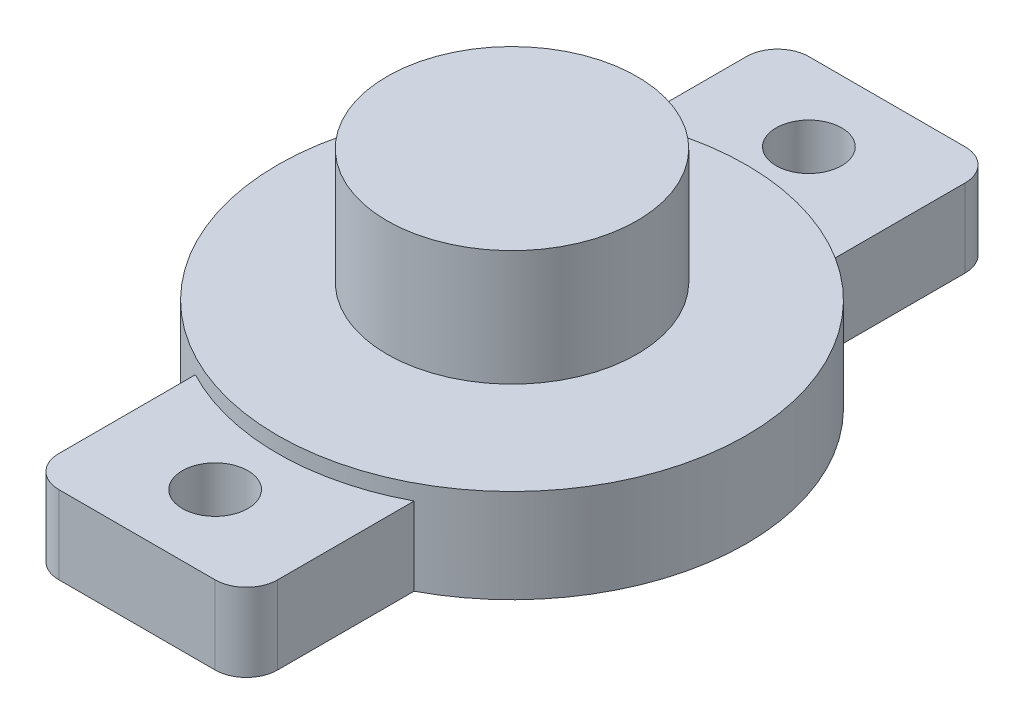
ISO-10303-21;
HEADER;
FILE_DESCRIPTION(('STEP AP214'),'2;1');
FILE_NAME('part.step','',(''),(''),'','','');
FILE_SCHEMA(('AUTOMOTIVE_DESIGN { 1 0 10303 214 1 1 1 1 }'));
ENDSEC;
DATA;
#1=APPLICATION_CONTEXT('core data for automotive mechanical design processes');
#2=APPLICATION_PROTOCOL_DEFINITION('international standard','automotive_design',2000,#1);
#3=PRODUCT_CONTEXT('',#1,'mechanical');
#4=PRODUCT('Part','Part','',(#3));
#5=PRODUCT_RELATED_PRODUCT_CATEGORY('part','',(#4));
#6=PRODUCT_DEFINITION_FORMATION('','',#4);
#7=PRODUCT_DEFINITION_CONTEXT('part definition',#1,'design');
#8=PRODUCT_DEFINITION('design','',#6,#7);
#9=PRODUCT_DEFINITION_SHAPE('','',#8);
#10=(LENGTH_UNIT() NAMED_UNIT(*) SI_UNIT(.MILLI.,.METRE.));
#11=(NAMED_UNIT(*) PLANE_ANGLE_UNIT() SI_UNIT($,.RADIAN.));
#12=(NAMED_UNIT(*) SI_UNIT($,.STERADIAN.) SOLID_ANGLE_UNIT());
#13=UNCERTAINTY_MEASURE_WITH_UNIT(LENGTH_MEASURE(1.E-05),#10,'distance_accuracy_value','');
#14=(GEOMETRIC_REPRESENTATION_CONTEXT(3) GLOBAL_UNCERTAINTY_ASSIGNED_CONTEXT((#13)) GLOBAL_UNIT_ASSIGNED_CONTEXT((#10,
#11,#12)) REPRESENTATION_CONTEXT('',''));
#15=CARTESIAN_POINT('',(0.,0.,0.));
#16=DIRECTION('',(0.,0.,1.));
#17=DIRECTION('',(1.,0.,0.));
#18=AXIS2_PLACEMENT_3D('',#15,#16,#17);
#19=CARTESIAN_POINT('',(0.,3.,0.));
#20=DIRECTION('',(0.,1.,0.));
#21=DIRECTION('',(0.,0.,1.));
#22=AXIS2_PLACEMENT_3D('',#19,#20,#21);
#23=PLANE('',#22);
#24=CARTESIAN_POINT('',(0.,3.,0.));
#25=DIRECTION('',(0.,1.,0.));
#26=DIRECTION('',(0.,0.,1.));
#27=AXIS2_PLACEMENT_3D('',#24,#25,#26);
#28=CIRCLE('',#27,7.5);
#29=CARTESIAN_POINT('',(0.,3.,7.5));
#30=VERTEX_POINT('',#29);
#31=EDGE_CURVE('E148',#30,#30,#28,.T.);
#32=ORIENTED_EDGE('',*,*,#31,.T.);
#33=EDGE_LOOP('',(#32));
#34=FACE_BOUND('',#33,.T.);
#35=CARTESIAN_POINT('',(0.,3.,0.));
#36=DIRECTION('',(0.,1.,0.));
#37=DIRECTION('',(0.,0.,1.));
#38=AXIS2_PLACEMENT_3D('',#35,#36,#37);
#39=CIRCLE('',#38,1.56120543949607);
#40=CARTESIAN_POINT('',(0.,3.,1.56120543949607));
#41=VERTEX_POINT('',#40);
#42=EDGE_CURVE('E441',#41,#41,#39,.T.);
#43=ORIENTED_EDGE('',*,*,#42,.F.);
#44=EDGE_LOOP('',(#43));
#45=FACE_BOUND('',#44,.T.);
#46=ADVANCED_FACE('F34',(#34,#45),#23,.T.);
#47=CARTESIAN_POINT('',(3.5,2.5,12.));
#48=DIRECTION('',(-1.,0.,0.));
#49=DIRECTION('',(0.,0.,1.));
#50=AXIS2_PLACEMENT_3D('',#47,#48,#49);
#51=PLANE('',#50);
#52=DIRECTION('',(0.,-1.,0.));
#53=VECTOR('',#52,1.);
#54=CARTESIAN_POINT('',(3.5,3.,-6.6332495807108));
#55=LINE('',#54,#53);
#56=CARTESIAN_POINT('',(3.5,0.,-6.6332495807108));
#57=VERTEX_POINT('',#56);
#58=CARTESIAN_POINT('',(3.5,2.5,-6.6332495807108));
#59=VERTEX_POINT('',#58);
#60=EDGE_CURVE('E143',#57,#59,#55,.F.);
#61=ORIENTED_EDGE('',*,*,#60,.F.);
#62=DIRECTION('',(0.,0.,-1.));
#63=VECTOR('',#62,1.);
#64=CARTESIAN_POINT('',(3.5,0.,12.));
#65=LINE('',#64,#63);
#66=CARTESIAN_POINT('',(3.5,0.,-11.));
#67=VERTEX_POINT('',#66);
#68=EDGE_CURVE('E161',#57,#67,#65,.T.);
#69=ORIENTED_EDGE('',*,*,#68,.T.);
#70=DIRECTION('',(0.,-1.,0.));
#71=VECTOR('',#70,1.);
#72=CARTESIAN_POINT('',(3.5,2.5,-11.));
#73=LINE('',#72,#71);
#74=CARTESIAN_POINT('',(3.5,2.5,-11.));
#75=VERTEX_POINT('',#74);
#76=EDGE_CURVE('E197',#67,#75,#73,.F.);
#77=ORIENTED_EDGE('',*,*,#76,.T.);
#78=DIRECTION('',(0.,0.,-1.));
#79=VECTOR('',#78,1.);
#80=CARTESIAN_POINT('',(3.5,2.5,12.));
#81=LINE('',#80,#79);
#82=EDGE_CURVE('E165',#59,#75,#81,.T.);
#83=ORIENTED_EDGE('',*,*,#82,.F.);
#84=EDGE_LOOP('',(#61,#69,#77,#83));
#85=FACE_BOUND('',#84,.T.);
#86=ADVANCED_FACE('F257',(#85),#51,.F.);
#87=DIRECTION('',(0.,-1.,0.));
#88=VECTOR('',#87,1.);
#89=CARTESIAN_POINT('',(3.5,3.,6.6332495807108));
#90=LINE('',#89,#88);
#91=CARTESIAN_POINT('',(3.5,2.5,6.6332495807108));
#92=VERTEX_POINT('',#91);
#93=CARTESIAN_POINT('',(3.5,0.,6.6332495807108));
#94=VERTEX_POINT('',#93);
#95=EDGE_CURVE('E156',#92,#94,#90,.T.);
#96=ORIENTED_EDGE('',*,*,#95,.F.);
#97=CARTESIAN_POINT('',(3.5,2.5,11.));
#98=VERTEX_POINT('',#97);
#99=EDGE_CURVE('E162',#98,#92,#81,.T.);
#100=ORIENTED_EDGE('',*,*,#99,.F.);
#101=DIRECTION('',(0.,-1.,0.));
#102=VECTOR('',#101,1.);
#103=CARTESIAN_POINT('',(3.5,2.5,11.));
#104=LINE('',#103,#102);
#105=CARTESIAN_POINT('',(3.5,0.,11.));
#106=VERTEX_POINT('',#105);
#107=EDGE_CURVE('E194',#98,#106,#104,.T.);
#108=ORIENTED_EDGE('',*,*,#107,.T.);
#109=EDGE_CURVE('E170',#106,#94,#65,.T.);
#110=ORIENTED_EDGE('',*,*,#109,.T.);
#111=EDGE_LOOP('',(#96,#100,#108,#110));
#112=FACE_BOUND('',#111,.T.);
#113=ADVANCED_FACE('F263',(#112),#51,.F.);
#114=CARTESIAN_POINT('',(-3.5,2.5,12.));
#115=DIRECTION('',(1.,0.,0.));
#116=DIRECTION('',(0.,0.,-1.));
#117=AXIS2_PLACEMENT_3D('',#114,#115,#116);
#118=PLANE('',#117);
#119=DIRECTION('',(0.,-1.,0.));
#120=VECTOR('',#119,1.);
#121=CARTESIAN_POINT('',(-3.5,3.,6.6332495807108));
#122=LINE('',#121,#120);
#123=CARTESIAN_POINT('',(-3.5,0.,6.6332495807108));
#124=VERTEX_POINT('',#123);
#125=CARTESIAN_POINT('',(-3.5,2.5,6.6332495807108));
#126=VERTEX_POINT('',#125);
#127=EDGE_CURVE('E153',#124,#126,#122,.F.);
#128=ORIENTED_EDGE('',*,*,#127,.F.);
#129=DIRECTION('',(0.,0.,1.));
#130=VECTOR('',#129,1.);
#131=CARTESIAN_POINT('',(-3.5,0.,12.));
#132=LINE('',#131,#130);
#133=CARTESIAN_POINT('',(-3.5,0.,11.));
#134=VERTEX_POINT('',#133);
#135=EDGE_CURVE('E175',#124,#134,#132,.T.);
#136=ORIENTED_EDGE('',*,*,#135,.T.);
#137=DIRECTION('',(0.,-1.,0.));
#138=VECTOR('',#137,1.);
#139=CARTESIAN_POINT('',(-3.5,2.5,11.));
#140=LINE('',#139,#138);
#141=CARTESIAN_POINT('',(-3.5,2.5,11.));
#142=VERTEX_POINT('',#141);
#143=EDGE_CURVE('E207',#134,#142,#140,.F.);
#144=ORIENTED_EDGE('',*,*,#143,.T.);
#145=DIRECTION('',(0.,0.,1.));
#146=VECTOR('',#145,1.);
#147=CARTESIAN_POINT('',(-3.5,2.5,12.));
#148=LINE('',#147,#146);
#149=EDGE_CURVE('E133',#126,#142,#148,.T.);
#150=ORIENTED_EDGE('',*,*,#149,.F.);
#151=EDGE_LOOP('',(#128,#136,#144,#150));
#152=FACE_BOUND('',#151,.T.);
#153=ADVANCED_FACE('F235',(#152),#118,.F.);
#154=DIRECTION('',(0.,-1.,0.));
#155=VECTOR('',#154,1.);
#156=CARTESIAN_POINT('',(-3.5,3.,-6.6332495807108));
#157=LINE('',#156,#155);
#158=CARTESIAN_POINT('',(-3.5,2.5,-6.6332495807108));
#159=VERTEX_POINT('',#158);
#160=CARTESIAN_POINT('',(-3.5,0.,-6.6332495807108));
#161=VERTEX_POINT('',#160);
#162=EDGE_CURVE('E136',#159,#161,#157,.T.);
#163=ORIENTED_EDGE('',*,*,#162,.F.);
#164=CARTESIAN_POINT('',(-3.5,2.5,-11.));
#165=VERTEX_POINT('',#164);
#166=EDGE_CURVE('E123',#165,#159,#148,.T.);
#167=ORIENTED_EDGE('',*,*,#166,.F.);
#168=DIRECTION('',(0.,-1.,0.));
#169=VECTOR('',#168,1.);
#170=CARTESIAN_POINT('',(-3.5,2.5,-11.));
#171=LINE('',#170,#169);
#172=CARTESIAN_POINT('',(-3.5,0.,-11.));
#173=VERTEX_POINT('',#172);
#174=EDGE_CURVE('E210',#165,#173,#171,.T.);
#175=ORIENTED_EDGE('',*,*,#174,.T.);
#176=EDGE_CURVE('E139',#173,#161,#132,.T.);
#177=ORIENTED_EDGE('',*,*,#176,.T.);
#178=EDGE_LOOP('',(#163,#167,#175,#177));
#179=FACE_BOUND('',#178,.T.);
#180=ADVANCED_FACE('F137',(#179),#118,.F.);
#181=CARTESIAN_POINT('',(0.,2.5,0.));
#182=DIRECTION('',(0.,-1.,0.));
#183=DIRECTION('',(0.,0.,-1.));
#184=AXIS2_PLACEMENT_3D('',#181,#182,#183);
#185=PLANE('',#184);
#186=CARTESIAN_POINT('',(0.,2.5,9.5));
#187=DIRECTION('',(0.,1.,0.));
#188=DIRECTION('',(0.,0.,1.));
#189=AXIS2_PLACEMENT_3D('',#186,#187,#188);
#190=CIRCLE('',#189,1.05);
#191=CARTESIAN_POINT('',(0.,2.5,10.55));
#192=VERTEX_POINT('',#191);
#193=EDGE_CURVE('E225',#192,#192,#190,.T.);
#194=ORIENTED_EDGE('',*,*,#193,.F.);
#195=EDGE_LOOP('',(#194));
#196=FACE_BOUND('',#195,.T.);
#197=CARTESIAN_POINT('',(0.,2.5,0.));
#198=DIRECTION('',(0.,-1.,0.));
#199=DIRECTION('',(0.,0.,-1.));
#200=AXIS2_PLACEMENT_3D('',#197,#198,#199);
#201=CIRCLE('',#200,7.5);
#202=EDGE_CURVE('E51',#126,#92,#201,.F.);
#203=ORIENTED_EDGE('',*,*,#202,.F.);
#204=ORIENTED_EDGE('',*,*,#149,.T.);
#205=CARTESIAN_POINT('',(-2.5,2.5,11.));
#206=DIRECTION('',(0.,-1.,0.));
#207=DIRECTION('',(0.,0.,-1.));
#208=AXIS2_PLACEMENT_3D('',#205,#206,#207);
#209=CIRCLE('',#208,1.);
#210=CARTESIAN_POINT('',(-2.5,2.5,12.));
#211=VERTEX_POINT('',#210);
#212=EDGE_CURVE('E200',#142,#211,#209,.F.);
#213=ORIENTED_EDGE('',*,*,#212,.T.);
#214=DIRECTION('',(1.,0.,0.));
#215=VECTOR('',#214,1.);
#216=CARTESIAN_POINT('',(-3.5,2.5,12.));
#217=LINE('',#216,#215);
#218=CARTESIAN_POINT('',(2.5,2.5,12.));
#219=VERTEX_POINT('',#218);
#220=EDGE_CURVE('E132',#211,#219,#217,.T.);
#221=ORIENTED_EDGE('',*,*,#220,.T.);
#222=CARTESIAN_POINT('',(2.5,2.5,11.));
#223=DIRECTION('',(0.,-1.,0.));
#224=DIRECTION('',(0.,0.,-1.));
#225=AXIS2_PLACEMENT_3D('',#222,#223,#224);
#226=CIRCLE('',#225,1.);
#227=EDGE_CURVE('E202',#219,#98,#226,.F.);
#228=ORIENTED_EDGE('',*,*,#227,.T.);
#229=ORIENTED_EDGE('',*,*,#99,.T.);
#230=EDGE_LOOP('',(#203,#204,#213,#221,#228,#229));
#231=FACE_BOUND('',#230,.T.);
#232=ADVANCED_FACE('F237',(#196,#231),#185,.F.);
#233=CARTESIAN_POINT('',(0.,2.5,-9.5));
#234=DIRECTION('',(0.,1.,0.));
#235=DIRECTION('',(0.,0.,1.));
#236=AXIS2_PLACEMENT_3D('',#233,#234,#235);
#237=CIRCLE('',#236,1.05);
#238=CARTESIAN_POINT('',(0.,2.5,-8.45));
#239=VERTEX_POINT('',#238);
#240=EDGE_CURVE('E216',#239,#239,#237,.T.);
#241=ORIENTED_EDGE('',*,*,#240,.F.);
#242=EDGE_LOOP('',(#241));
#243=FACE_BOUND('',#242,.T.);
#244=EDGE_CURVE('E59',#59,#159,#201,.F.);
#245=ORIENTED_EDGE('',*,*,#244,.F.);
#246=ORIENTED_EDGE('',*,*,#82,.T.);
#247=CARTESIAN_POINT('',(2.5,2.5,-11.));
#248=DIRECTION('',(0.,-1.,0.));
#249=DIRECTION('',(0.,0.,-1.));
#250=AXIS2_PLACEMENT_3D('',#247,#248,#249);
#251=CIRCLE('',#250,1.);
#252=CARTESIAN_POINT('',(2.5,2.5,-12.));
#253=VERTEX_POINT('',#252);
#254=EDGE_CURVE('E205',#75,#253,#251,.F.);
#255=ORIENTED_EDGE('',*,*,#254,.T.);
#256=DIRECTION('',(-1.,0.,0.));
#257=VECTOR('',#256,1.);
#258=CARTESIAN_POINT('',(-3.5,2.5,-12.));
#259=LINE('',#258,#257);
#260=CARTESIAN_POINT('',(-2.5,2.5,-12.));
#261=VERTEX_POINT('',#260);
#262=EDGE_CURVE('E164',#253,#261,#259,.T.);
#263=ORIENTED_EDGE('',*,*,#262,.T.);
#264=CARTESIAN_POINT('',(-2.5,2.5,-11.));
#265=DIRECTION('',(0.,-1.,0.));
#266=DIRECTION('',(0.,0.,-1.));
#267=AXIS2_PLACEMENT_3D('',#264,#265,#266);
#268=CIRCLE('',#267,1.);
#269=EDGE_CURVE('E128',#261,#165,#268,.F.);
#270=ORIENTED_EDGE('',*,*,#269,.T.);
#271=ORIENTED_EDGE('',*,*,#166,.T.);
#272=EDGE_LOOP('',(#245,#246,#255,#263,#270,#271));
#273=FACE_BOUND('',#272,.T.);
#274=ADVANCED_FACE('F125',(#243,#273),#185,.F.);
#275=CARTESIAN_POINT('',(-3.5,2.5,-12.));
#276=DIRECTION('',(0.,0.,1.));
#277=DIRECTION('',(1.,0.,0.));
#278=AXIS2_PLACEMENT_3D('',#275,#276,#277);
#279=PLANE('',#278);
#280=ORIENTED_EDGE('',*,*,#262,.F.);
#281=DIRECTION('',(0.,-1.,0.));
#282=VECTOR('',#281,1.);
#283=CARTESIAN_POINT('',(2.5,2.5,-12.));
#284=LINE('',#283,#282);
#285=CARTESIAN_POINT('',(2.5,0.,-12.));
#286=VERTEX_POINT('',#285);
#287=EDGE_CURVE('E181',#253,#286,#284,.T.);
#288=ORIENTED_EDGE('',*,*,#287,.T.);
#289=DIRECTION('',(-1.,0.,0.));
#290=VECTOR('',#289,1.);
#291=CARTESIAN_POINT('',(-3.5,0.,-12.));
#292=LINE('',#291,#290);
#293=CARTESIAN_POINT('',(-2.5,0.,-12.));
#294=VERTEX_POINT('',#293);
#295=EDGE_CURVE('E172',#286,#294,#292,.T.);
#296=ORIENTED_EDGE('',*,*,#295,.T.);
#297=DIRECTION('',(0.,-1.,0.));
#298=VECTOR('',#297,1.);
#299=CARTESIAN_POINT('',(-2.5,2.5,-12.));
#300=LINE('',#299,#298);
#301=EDGE_CURVE('E169',#294,#261,#300,.F.);
#302=ORIENTED_EDGE('',*,*,#301,.T.);
#303=EDGE_LOOP('',(#280,#288,#296,#302));
#304=FACE_BOUND('',#303,.T.);
#305=ADVANCED_FACE('F279',(#304),#279,.F.);
#306=CARTESIAN_POINT('',(-3.5,2.5,12.));
#307=DIRECTION('',(0.,0.,-1.));
#308=DIRECTION('',(-1.,0.,0.));
#309=AXIS2_PLACEMENT_3D('',#306,#307,#308);
#310=PLANE('',#309);
#311=DIRECTION('',(1.,0.,0.));
#312=VECTOR('',#311,1.);
#313=CARTESIAN_POINT('',(-3.5,0.,12.));
#314=LINE('',#313,#312);
#315=CARTESIAN_POINT('',(-2.5,0.,12.));
#316=VERTEX_POINT('',#315);
#317=CARTESIAN_POINT('',(2.5,0.,12.));
#318=VERTEX_POINT('',#317);
#319=EDGE_CURVE('E177',#316,#318,#314,.T.);
#320=ORIENTED_EDGE('',*,*,#319,.T.);
#321=DIRECTION('',(0.,-1.,0.));
#322=VECTOR('',#321,1.);
#323=CARTESIAN_POINT('',(2.5,2.5,12.));
#324=LINE('',#323,#322);
#325=EDGE_CURVE('E11',#318,#219,#324,.F.);
#326=ORIENTED_EDGE('',*,*,#325,.T.);
#327=ORIENTED_EDGE('',*,*,#220,.F.);
#328=DIRECTION('',(0.,-1.,0.));
#329=VECTOR('',#328,1.);
#330=CARTESIAN_POINT('',(-2.5,2.5,12.));
#331=LINE('',#330,#329);
#332=EDGE_CURVE('E43',#211,#316,#331,.T.);
#333=ORIENTED_EDGE('',*,*,#332,.T.);
#334=EDGE_LOOP('',(#320,#326,#327,#333));
#335=FACE_BOUND('',#334,.T.);
#336=ADVANCED_FACE('F243',(#335),#310,.F.);
#337=CARTESIAN_POINT('',(0.,0.,0.));
#338=DIRECTION('',(0.,-1.,0.));
#339=DIRECTION('',(0.,0.,-1.));
#340=AXIS2_PLACEMENT_3D('',#337,#338,#339);
#341=PLANE('',#340);
#342=CARTESIAN_POINT('',(0.,0.,9.5));
#343=DIRECTION('',(0.,-1.,0.));
#344=DIRECTION('',(0.,0.,-1.));
#345=AXIS2_PLACEMENT_3D('',#342,#343,#344);
#346=CIRCLE('',#345,1.05);
#347=CARTESIAN_POINT('',(0.,0.,8.45));
#348=VERTEX_POINT('',#347);
#349=EDGE_CURVE('E38',#348,#348,#346,.T.);
#350=ORIENTED_EDGE('',*,*,#349,.F.);
#351=EDGE_LOOP('',(#350));
#352=FACE_BOUND('',#351,.T.);
#353=CARTESIAN_POINT('',(0.,0.,-9.5));
#354=DIRECTION('',(0.,-1.,0.));
#355=DIRECTION('',(0.,0.,-1.));
#356=AXIS2_PLACEMENT_3D('',#353,#354,#355);
#357=CIRCLE('',#356,1.05);
#358=CARTESIAN_POINT('',(0.,0.,-10.55));
#359=VERTEX_POINT('',#358);
#360=EDGE_CURVE('E213',#359,#359,#357,.T.);
#361=ORIENTED_EDGE('',*,*,#360,.F.);
#362=EDGE_LOOP('',(#361));
#363=FACE_BOUND('',#362,.T.);
#364=ORIENTED_EDGE('',*,*,#68,.F.);
#365=CARTESIAN_POINT('',(0.,0.,0.));
#366=DIRECTION('',(0.,-1.,0.));
#367=DIRECTION('',(0.,0.,-1.));
#368=AXIS2_PLACEMENT_3D('',#365,#366,#367);
#369=CIRCLE('',#368,7.5);
#370=EDGE_CURVE('E215',#94,#57,#369,.F.);
#371=ORIENTED_EDGE('',*,*,#370,.F.);
#372=ORIENTED_EDGE('',*,*,#109,.F.);
#373=CARTESIAN_POINT('',(2.5,0.,11.));
#374=DIRECTION('',(0.,-1.,0.));
#375=DIRECTION('',(0.,0.,-1.));
#376=AXIS2_PLACEMENT_3D('',#373,#374,#375);
#377=CIRCLE('',#376,1.);
#378=EDGE_CURVE('E187',#106,#318,#377,.T.);
#379=ORIENTED_EDGE('',*,*,#378,.T.);
#380=ORIENTED_EDGE('',*,*,#319,.F.);
#381=CARTESIAN_POINT('',(-2.5,0.,11.));
#382=DIRECTION('',(0.,-1.,0.));
#383=DIRECTION('',(0.,0.,-1.));
#384=AXIS2_PLACEMENT_3D('',#381,#382,#383);
#385=CIRCLE('',#384,1.);
#386=EDGE_CURVE('E184',#316,#134,#385,.T.);
#387=ORIENTED_EDGE('',*,*,#386,.T.);
#388=ORIENTED_EDGE('',*,*,#135,.F.);
#389=EDGE_CURVE('E151',#161,#124,#369,.F.);
#390=ORIENTED_EDGE('',*,*,#389,.F.);
#391=ORIENTED_EDGE('',*,*,#176,.F.);
#392=CARTESIAN_POINT('',(-2.5,0.,-11.));
#393=DIRECTION('',(0.,-1.,0.));
#394=DIRECTION('',(0.,0.,-1.));
#395=AXIS2_PLACEMENT_3D('',#392,#393,#394);
#396=CIRCLE('',#395,1.);
#397=EDGE_CURVE('E189',#173,#294,#396,.T.);
#398=ORIENTED_EDGE('',*,*,#397,.T.);
#399=ORIENTED_EDGE('',*,*,#295,.F.);
#400=CARTESIAN_POINT('',(2.5,0.,-11.));
#401=DIRECTION('',(0.,-1.,0.));
#402=DIRECTION('',(0.,0.,-1.));
#403=AXIS2_PLACEMENT_3D('',#400,#401,#402);
#404=CIRCLE('',#403,1.);
#405=EDGE_CURVE('E191',#286,#67,#404,.T.);
#406=ORIENTED_EDGE('',*,*,#405,.T.);
#407=EDGE_LOOP('',(#364,#371,#372,#379,#380,#387,#388,#390,#391,#398,#399,#406));
#408=FACE_BOUND('',#407,.T.);
#409=ADVANCED_FACE('F231',(#352,#363,#408),#341,.T.);
#410=CARTESIAN_POINT('',(2.5,2.5,-11.));
#411=DIRECTION('',(0.,-1.,0.));
#412=DIRECTION('',(0.,0.,-1.));
#413=AXIS2_PLACEMENT_3D('',#410,#411,#412);
#414=CYLINDRICAL_SURFACE('',#413,1.);
#415=ORIENTED_EDGE('',*,*,#254,.F.);
#416=ORIENTED_EDGE('',*,*,#76,.F.);
#417=ORIENTED_EDGE('',*,*,#405,.F.);
#418=ORIENTED_EDGE('',*,*,#287,.F.);
#419=EDGE_LOOP('',(#415,#416,#417,#418));
#420=FACE_BOUND('',#419,.T.);
#421=ADVANCED_FACE('F275',(#420),#414,.T.);
#422=CARTESIAN_POINT('',(-2.5,2.5,-11.));
#423=DIRECTION('',(0.,-1.,0.));
#424=DIRECTION('',(0.,0.,-1.));
#425=AXIS2_PLACEMENT_3D('',#422,#423,#424);
#426=CYLINDRICAL_SURFACE('',#425,1.);
#427=ORIENTED_EDGE('',*,*,#269,.F.);
#428=ORIENTED_EDGE('',*,*,#301,.F.);
#429=ORIENTED_EDGE('',*,*,#397,.F.);
#430=ORIENTED_EDGE('',*,*,#174,.F.);
#431=EDGE_LOOP('',(#427,#428,#429,#430));
#432=FACE_BOUND('',#431,.T.);
#433=ADVANCED_FACE('F254',(#432),#426,.T.);
#434=CARTESIAN_POINT('',(2.5,2.5,11.));
#435=DIRECTION('',(0.,-1.,0.));
#436=DIRECTION('',(0.,0.,-1.));
#437=AXIS2_PLACEMENT_3D('',#434,#435,#436);
#438=CYLINDRICAL_SURFACE('',#437,1.);
#439=ORIENTED_EDGE('',*,*,#227,.F.);
#440=ORIENTED_EDGE('',*,*,#325,.F.);
#441=ORIENTED_EDGE('',*,*,#378,.F.);
#442=ORIENTED_EDGE('',*,*,#107,.F.);
#443=EDGE_LOOP('',(#439,#440,#441,#442));
#444=FACE_BOUND('',#443,.T.);
#445=ADVANCED_FACE('F246',(#444),#438,.T.);
#446=CARTESIAN_POINT('',(-2.5,2.5,11.));
#447=DIRECTION('',(0.,-1.,0.));
#448=DIRECTION('',(0.,0.,-1.));
#449=AXIS2_PLACEMENT_3D('',#446,#447,#448);
#450=CYLINDRICAL_SURFACE('',#449,1.);
#451=ORIENTED_EDGE('',*,*,#212,.F.);
#452=ORIENTED_EDGE('',*,*,#143,.F.);
#453=ORIENTED_EDGE('',*,*,#386,.F.);
#454=ORIENTED_EDGE('',*,*,#332,.F.);
#455=EDGE_LOOP('',(#451,#452,#453,#454));
#456=FACE_BOUND('',#455,.T.);
#457=ADVANCED_FACE('F36',(#456),#450,.T.);
#458=CARTESIAN_POINT('',(0.,3.,0.));
#459=DIRECTION('',(0.,-1.,0.));
#460=DIRECTION('',(0.,0.,-1.));
#461=AXIS2_PLACEMENT_3D('',#458,#459,#460);
#462=CYLINDRICAL_SURFACE('',#461,7.5);
#463=ORIENTED_EDGE('',*,*,#31,.F.);
#464=EDGE_LOOP('',(#463));
#465=FACE_BOUND('',#464,.T.);
#466=ORIENTED_EDGE('',*,*,#202,.T.);
#467=ORIENTED_EDGE('',*,*,#95,.T.);
#468=ORIENTED_EDGE('',*,*,#370,.T.);
#469=ORIENTED_EDGE('',*,*,#60,.T.);
#470=ORIENTED_EDGE('',*,*,#244,.T.);
#471=ORIENTED_EDGE('',*,*,#162,.T.);
#472=ORIENTED_EDGE('',*,*,#389,.T.);
#473=ORIENTED_EDGE('',*,*,#127,.T.);
#474=EDGE_LOOP('',(#466,#467,#468,#469,#470,#471,#472,#473));
#475=FACE_BOUND('',#474,.T.);
#476=ADVANCED_FACE('F146',(#465,#475),#462,.T.);
#477=CARTESIAN_POINT('',(0.,-20.,-9.5));
#478=DIRECTION('',(0.,1.,0.));
#479=DIRECTION('',(0.,0.,1.));
#480=AXIS2_PLACEMENT_3D('',#477,#478,#479);
#481=CYLINDRICAL_SURFACE('',#480,1.05);
#482=ORIENTED_EDGE('',*,*,#360,.T.);
#483=EDGE_LOOP('',(#482));
#484=FACE_BOUND('',#483,.T.);
#485=ORIENTED_EDGE('',*,*,#240,.T.);
#486=EDGE_LOOP('',(#485));
#487=FACE_BOUND('',#486,.T.);
#488=ADVANCED_FACE('F251',(#484,#487),#481,.F.);
#489=CARTESIAN_POINT('',(0.,-20.,9.5));
#490=DIRECTION('',(0.,1.,0.));
#491=DIRECTION('',(0.,0.,1.));
#492=AXIS2_PLACEMENT_3D('',#489,#490,#491);
#493=CYLINDRICAL_SURFACE('',#492,1.05);
#494=ORIENTED_EDGE('',*,*,#349,.T.);
#495=EDGE_LOOP('',(#494));
#496=FACE_BOUND('',#495,.T.);
#497=ORIENTED_EDGE('',*,*,#193,.T.);
#498=EDGE_LOOP('',(#497));
#499=FACE_BOUND('',#498,.T.);
#500=ADVANCED_FACE('F383',(#496,#499),#493,.F.);
#501=CARTESIAN_POINT('',(0.,3.5,0.));
#502=DIRECTION('',(0.,-1.,0.));
#503=DIRECTION('',(0.,0.,-1.));
#504=AXIS2_PLACEMENT_3D('',#501,#502,#503);
#505=CYLINDRICAL_SURFACE('',#504,1.56120543949607);
#506=CARTESIAN_POINT('',(0.,3.5,0.));
#507=DIRECTION('',(0.,1.,0.));
#508=DIRECTION('',(0.,0.,1.));
#509=AXIS2_PLACEMENT_3D('',#506,#507,#508);
#510=CIRCLE('',#509,1.56120543949607);
#511=CARTESIAN_POINT('',(0.,3.5,1.56120543949607));
#512=VERTEX_POINT('',#511);
#513=EDGE_CURVE('E445',#512,#512,#510,.T.);
#514=ORIENTED_EDGE('',*,*,#513,.F.);
#515=EDGE_LOOP('',(#514));
#516=FACE_BOUND('',#515,.T.);
#517=ORIENTED_EDGE('',*,*,#42,.T.);
#518=EDGE_LOOP('',(#517));
#519=FACE_BOUND('',#518,.T.);
#520=ADVANCED_FACE('F390',(#516,#519),#505,.T.);
#521=CARTESIAN_POINT('',(0.,3.5,0.));
#522=DIRECTION('',(0.,1.,0.));
#523=DIRECTION('',(0.,0.,1.));
#524=AXIS2_PLACEMENT_3D('',#521,#522,#523);
#525=PLANE('',#524);
#526=CARTESIAN_POINT('',(0.,3.5,0.));
#527=DIRECTION('',(0.,1.,0.));
#528=DIRECTION('',(0.,0.,1.));
#529=AXIS2_PLACEMENT_3D('',#526,#527,#528);
#530=CIRCLE('',#529,4.);
#531=CARTESIAN_POINT('',(0.,3.5,4.));
#532=VERTEX_POINT('',#531);
#533=EDGE_CURVE('E442',#532,#532,#530,.T.);
#534=ORIENTED_EDGE('',*,*,#533,.F.);
#535=EDGE_LOOP('',(#534));
#536=FACE_BOUND('',#535,.T.);
#537=ORIENTED_EDGE('',*,*,#513,.T.);
#538=EDGE_LOOP('',(#537));
#539=FACE_BOUND('',#538,.T.);
#540=ADVANCED_FACE('F402',(#536,#539),#525,.F.);
#541=CARTESIAN_POINT('',(0.,7.2,0.));
#542=DIRECTION('',(0.,-1.,0.));
#543=DIRECTION('',(0.,0.,-1.));
#544=AXIS2_PLACEMENT_3D('',#541,#542,#543);
#545=CYLINDRICAL_SURFACE('',#544,4.);
#546=CARTESIAN_POINT('',(0.,7.2,0.));
#547=DIRECTION('',(0.,1.,0.));
#548=DIRECTION('',(0.,0.,1.));
#549=AXIS2_PLACEMENT_3D('',#546,#547,#548);
#550=CIRCLE('',#549,4.);
#551=CARTESIAN_POINT('',(0.,7.2,4.));
#552=VERTEX_POINT('',#551);
#553=EDGE_CURVE('E440',#552,#552,#550,.T.);
#554=ORIENTED_EDGE('',*,*,#553,.F.);
#555=EDGE_LOOP('',(#554));
#556=FACE_BOUND('',#555,.T.);
#557=ORIENTED_EDGE('',*,*,#533,.T.);
#558=EDGE_LOOP('',(#557));
#559=FACE_BOUND('',#558,.T.);
#560=ADVANCED_FACE('F411',(#556,#559),#545,.T.);
#561=CARTESIAN_POINT('',(0.,7.2,0.));
#562=DIRECTION('',(0.,1.,0.));
#563=DIRECTION('',(0.,0.,1.));
#564=AXIS2_PLACEMENT_3D('',#561,#562,#563);
#565=PLANE('',#564);
#566=ORIENTED_EDGE('',*,*,#553,.T.);
#567=EDGE_LOOP('',(#566));
#568=FACE_BOUND('',#567,.T.);
#569=ADVANCED_FACE('F420',(#568),#565,.T.);
#570=CLOSED_SHELL('',(#46,#86,#113,#153,#180,#232,#274,#305,#336,#409,#421,#433,#445,#457,#476,
#488,#500,#520,#540,#560,#569));
#571=MANIFOLD_SOLID_BREP('B2',#570);
#572=ADVANCED_BREP_SHAPE_REPRESENTATION('',(#18,#571),#14);
#573=SHAPE_DEFINITION_REPRESENTATION(#9,#572);
ENDSEC;
END-ISO-10303-21;
